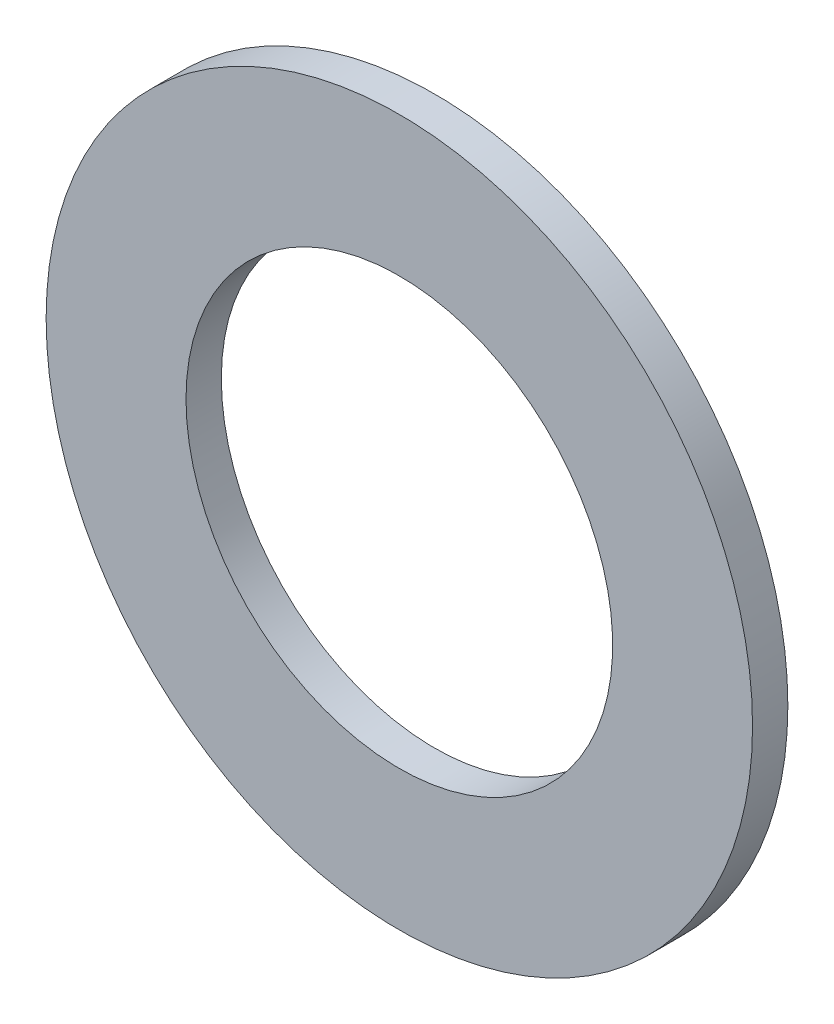
ISO-10303-21;
HEADER;
FILE_DESCRIPTION(('STEP AP214'),'2;1');
FILE_NAME('part.step','',(''),(''),'','','');
FILE_SCHEMA(('AUTOMOTIVE_DESIGN { 1 0 10303 214 1 1 1 1 }'));
ENDSEC;
DATA;
#1=APPLICATION_CONTEXT('core data for automotive mechanical design processes');
#2=APPLICATION_PROTOCOL_DEFINITION('international standard','automotive_design',2000,#1);
#3=PRODUCT_CONTEXT('',#1,'mechanical');
#4=PRODUCT('Part','Part','',(#3));
#5=PRODUCT_RELATED_PRODUCT_CATEGORY('part','',(#4));
#6=PRODUCT_DEFINITION_FORMATION('','',#4);
#7=PRODUCT_DEFINITION_CONTEXT('part definition',#1,'design');
#8=PRODUCT_DEFINITION('design','',#6,#7);
#9=PRODUCT_DEFINITION_SHAPE('','',#8);
#10=(LENGTH_UNIT() NAMED_UNIT(*) SI_UNIT(.MILLI.,.METRE.));
#11=(NAMED_UNIT(*) PLANE_ANGLE_UNIT() SI_UNIT($,.RADIAN.));
#12=(NAMED_UNIT(*) SI_UNIT($,.STERADIAN.) SOLID_ANGLE_UNIT());
#13=UNCERTAINTY_MEASURE_WITH_UNIT(LENGTH_MEASURE(1.E-05),#10,'distance_accuracy_value','');
#14=(GEOMETRIC_REPRESENTATION_CONTEXT(3) GLOBAL_UNCERTAINTY_ASSIGNED_CONTEXT((#13)) GLOBAL_UNIT_ASSIGNED_CONTEXT((#10,
#11,#12)) REPRESENTATION_CONTEXT('',''));
#15=CARTESIAN_POINT('',(0.,0.,0.));
#16=DIRECTION('',(0.,0.,1.));
#17=DIRECTION('',(1.,0.,0.));
#18=AXIS2_PLACEMENT_3D('',#15,#16,#17);
#19=CARTESIAN_POINT('',(0.,0.,-0.79375));
#20=DIRECTION('',(0.,0.,1.));
#21=DIRECTION('',(1.,0.,0.));
#22=AXIS2_PLACEMENT_3D('',#19,#20,#21);
#23=PLANE('',#22);
#24=CARTESIAN_POINT('',(0.,0.,-0.79375));
#25=DIRECTION('',(0.,0.,-1.));
#26=DIRECTION('',(-1.,0.,0.));
#27=AXIS2_PLACEMENT_3D('',#24,#25,#26);
#28=CIRCLE('',#27,9.5885);
#29=CARTESIAN_POINT('',(-9.5885,0.,-0.79375));
#30=VERTEX_POINT('',#29);
#31=EDGE_CURVE('E27',#30,#30,#28,.F.);
#32=ORIENTED_EDGE('',*,*,#31,.T.);
#33=EDGE_LOOP('',(#32));
#34=FACE_BOUND('',#33,.T.);
#35=CARTESIAN_POINT('',(0.,0.,-0.793750000373));
#36=DIRECTION('',(0.,0.,-1.));
#37=DIRECTION('',(-1.,0.,0.));
#38=AXIS2_PLACEMENT_3D('',#35,#36,#37);
#39=CIRCLE('',#38,15.875);
#40=CARTESIAN_POINT('',(-15.875,0.,-0.793750000373));
#41=VERTEX_POINT('',#40);
#42=EDGE_CURVE('E18',#41,#41,#39,.F.);
#43=ORIENTED_EDGE('',*,*,#42,.F.);
#44=EDGE_LOOP('',(#43));
#45=FACE_BOUND('',#44,.T.);
#46=ADVANCED_FACE('F15',(#34,#45),#23,.F.);
#47=CARTESIAN_POINT('',(0.,0.,0.79375));
#48=DIRECTION('',(0.,0.,-1.));
#49=DIRECTION('',(-1.,0.,0.));
#50=AXIS2_PLACEMENT_3D('',#47,#48,#49);
#51=CYLINDRICAL_SURFACE('',#50,15.875);
#52=ORIENTED_EDGE('',*,*,#42,.T.);
#53=EDGE_LOOP('',(#52));
#54=FACE_BOUND('',#53,.T.);
#55=CARTESIAN_POINT('',(0.,0.,0.79375));
#56=DIRECTION('',(0.,0.,-1.));
#57=DIRECTION('',(-1.,0.,0.));
#58=AXIS2_PLACEMENT_3D('',#55,#56,#57);
#59=CIRCLE('',#58,15.875);
#60=CARTESIAN_POINT('',(-15.875,0.,0.79375));
#61=VERTEX_POINT('',#60);
#62=EDGE_CURVE('E22',#61,#61,#59,.F.);
#63=ORIENTED_EDGE('',*,*,#62,.F.);
#64=EDGE_LOOP('',(#63));
#65=FACE_BOUND('',#64,.T.);
#66=ADVANCED_FACE('F35',(#54,#65),#51,.T.);
#67=CARTESIAN_POINT('',(0.,0.,0.79375));
#68=DIRECTION('',(0.,0.,-1.));
#69=DIRECTION('',(-1.,0.,0.));
#70=AXIS2_PLACEMENT_3D('',#67,#68,#69);
#71=CYLINDRICAL_SURFACE('',#70,9.5885);
#72=CARTESIAN_POINT('',(0.,0.,0.79375));
#73=DIRECTION('',(0.,0.,-1.));
#74=DIRECTION('',(-1.,0.,0.));
#75=AXIS2_PLACEMENT_3D('',#72,#73,#74);
#76=CIRCLE('',#75,9.5885);
#77=CARTESIAN_POINT('',(-9.5885,0.,0.79375));
#78=VERTEX_POINT('',#77);
#79=EDGE_CURVE('E10',#78,#78,#76,.T.);
#80=ORIENTED_EDGE('',*,*,#79,.F.);
#81=EDGE_LOOP('',(#80));
#82=FACE_BOUND('',#81,.T.);
#83=ORIENTED_EDGE('',*,*,#31,.F.);
#84=EDGE_LOOP('',(#83));
#85=FACE_BOUND('',#84,.T.);
#86=ADVANCED_FACE('F43',(#82,#85),#71,.F.);
#87=CARTESIAN_POINT('',(0.,0.,0.79375));
#88=DIRECTION('',(0.,0.,1.));
#89=DIRECTION('',(1.,0.,0.));
#90=AXIS2_PLACEMENT_3D('',#87,#88,#89);
#91=PLANE('',#90);
#92=ORIENTED_EDGE('',*,*,#79,.T.);
#93=EDGE_LOOP('',(#92));
#94=FACE_BOUND('',#93,.T.);
#95=ORIENTED_EDGE('',*,*,#62,.T.);
#96=EDGE_LOOP('',(#95));
#97=FACE_BOUND('',#96,.T.);
#98=ADVANCED_FACE('F44',(#94,#97),#91,.T.);
#99=CLOSED_SHELL('',(#46,#66,#86,#98));
#100=MANIFOLD_SOLID_BREP('B1',#99);
#101=ADVANCED_BREP_SHAPE_REPRESENTATION('',(#18,#100),#14);
#102=SHAPE_DEFINITION_REPRESENTATION(#9,#101);
ENDSEC;
END-ISO-10303-21;
